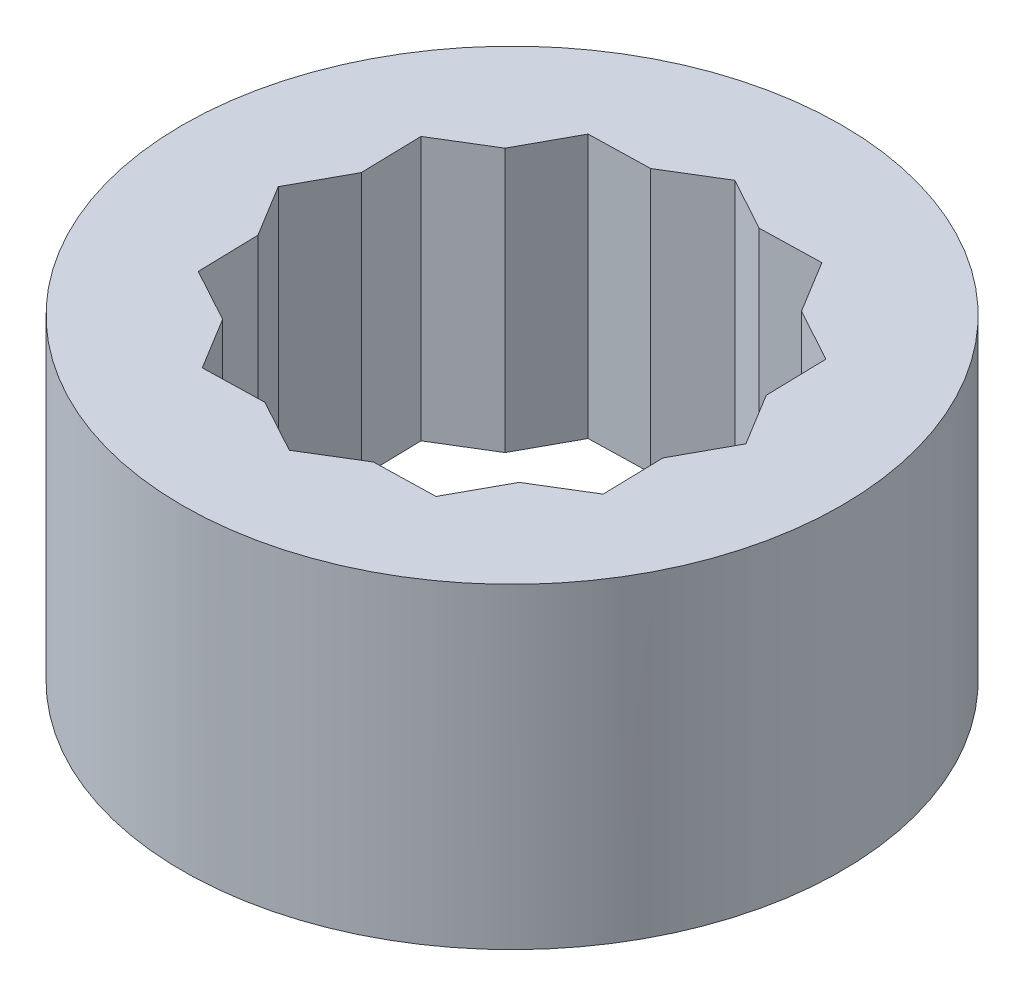
ISO-10303-21;
HEADER;
FILE_DESCRIPTION(('STEP AP214'),'2;1');
FILE_NAME('part.step','',(''),(''),'','','');
FILE_SCHEMA(('AUTOMOTIVE_DESIGN { 1 0 10303 214 1 1 1 1 }'));
ENDSEC;
DATA;
#1=APPLICATION_CONTEXT('core data for automotive mechanical design processes');
#2=APPLICATION_PROTOCOL_DEFINITION('international standard','automotive_design',2000,#1);
#3=PRODUCT_CONTEXT('',#1,'mechanical');
#4=PRODUCT('Part','Part','',(#3));
#5=PRODUCT_RELATED_PRODUCT_CATEGORY('part','',(#4));
#6=PRODUCT_DEFINITION_FORMATION('','',#4);
#7=PRODUCT_DEFINITION_CONTEXT('part definition',#1,'design');
#8=PRODUCT_DEFINITION('design','',#6,#7);
#9=PRODUCT_DEFINITION_SHAPE('','',#8);
#10=(LENGTH_UNIT() NAMED_UNIT(*) SI_UNIT(.MILLI.,.METRE.));
#11=(NAMED_UNIT(*) PLANE_ANGLE_UNIT() SI_UNIT($,.RADIAN.));
#12=(NAMED_UNIT(*) SI_UNIT($,.STERADIAN.) SOLID_ANGLE_UNIT());
#13=UNCERTAINTY_MEASURE_WITH_UNIT(LENGTH_MEASURE(1.E-05),#10,'distance_accuracy_value','');
#14=(GEOMETRIC_REPRESENTATION_CONTEXT(3) GLOBAL_UNCERTAINTY_ASSIGNED_CONTEXT((#13)) GLOBAL_UNIT_ASSIGNED_CONTEXT((#10,
#11,#12)) REPRESENTATION_CONTEXT('',''));
#15=CARTESIAN_POINT('',(0.,0.,0.));
#16=DIRECTION('',(0.,0.,1.));
#17=DIRECTION('',(1.,0.,0.));
#18=AXIS2_PLACEMENT_3D('',#15,#16,#17);
#19=CARTESIAN_POINT('',(0.,12.7,0.));
#20=DIRECTION('',(0.,-1.,0.));
#21=DIRECTION('',(0.,0.,-1.));
#22=AXIS2_PLACEMENT_3D('',#19,#20,#21);
#23=CYLINDRICAL_SURFACE('',#22,15.875);
#24=CARTESIAN_POINT('',(0.,12.7,0.));
#25=DIRECTION('',(0.,1.,0.));
#26=DIRECTION('',(0.,0.,1.));
#27=AXIS2_PLACEMENT_3D('',#24,#25,#26);
#28=CIRCLE('',#27,15.875);
#29=CARTESIAN_POINT('',(0.,12.7,15.875));
#30=VERTEX_POINT('',#29);
#31=EDGE_CURVE('E11',#30,#30,#28,.T.);
#32=ORIENTED_EDGE('',*,*,#31,.F.);
#33=EDGE_LOOP('',(#32));
#34=FACE_BOUND('',#33,.T.);
#35=CARTESIAN_POINT('',(0.,-2.54,0.));
#36=DIRECTION('',(0.,-1.,0.));
#37=DIRECTION('',(0.,0.,-1.));
#38=AXIS2_PLACEMENT_3D('',#35,#36,#37);
#39=CIRCLE('',#38,15.875);
#40=CARTESIAN_POINT('',(0.,-2.54,-15.875));
#41=VERTEX_POINT('',#40);
#42=EDGE_CURVE('E217',#41,#41,#39,.T.);
#43=ORIENTED_EDGE('',*,*,#42,.F.);
#44=EDGE_LOOP('',(#43));
#45=FACE_BOUND('',#44,.T.);
#46=ADVANCED_FACE('F33',(#34,#45),#23,.T.);
#47=CARTESIAN_POINT('',(0.,12.7,0.));
#48=DIRECTION('',(0.,1.,0.));
#49=DIRECTION('',(0.,0.,1.));
#50=AXIS2_PLACEMENT_3D('',#47,#48,#49);
#51=PLANE('',#50);
#52=DIRECTION('',(0.877865016499251,0.,0.478908146523704));
#53=VECTOR('',#52,1.);
#54=CARTESIAN_POINT('',(-4.56160009563828,12.7,8.36166428215537));
#55=LINE('',#54,#53);
#56=CARTESIAN_POINT('',(-9.38920921981397,12.7,5.72802323900318));
#57=VERTEX_POINT('',#56);
#58=CARTESIAN_POINT('',(-6.80210128742198,12.7,7.13938722033536));
#59=VERTEX_POINT('',#58);
#60=EDGE_CURVE('E47',#57,#59,#55,.T.);
#61=ORIENTED_EDGE('',*,*,#60,.F.);
#62=DIRECTION('',(0.0241858872807774,0.,0.999707478643849));
#63=VECTOR('',#62,1.);
#64=CARTESIAN_POINT('',(-9.52221373408266,12.7,0.230370576349405));
#65=LINE('',#64,#63);
#66=CARTESIAN_POINT('',(-9.46048612418995,12.7,2.78184005655339));
#67=VERTEX_POINT('',#66);
#68=EDGE_CURVE('E136',#67,#57,#65,.T.);
#69=ORIENTED_EDGE('',*,*,#68,.F.);
#70=DIRECTION('',(0.520799332120144,0.,0.853679129218474));
#71=VECTOR('',#70,1.);
#72=CARTESIAN_POINT('',(-8.13129370580596,12.7,4.96061363844437));
#73=LINE('',#72,#71);
#74=CARTESIAN_POINT('',(-10.9953053253075,12.7,0.266009028537395));
#75=VERTEX_POINT('',#74);
#76=EDGE_CURVE('E144',#75,#67,#73,.T.);
#77=ORIENTED_EDGE('',*,*,#76,.F.);
#78=DIRECTION('',(-0.478908146523704,0.,0.877865016499251));
#79=VECTOR('',#78,1.);
#80=CARTESIAN_POINT('',(-8.36166428215536,12.7,-4.56160009563828));
#81=LINE('',#80,#79);
#82=CARTESIAN_POINT('',(-9.58394134397538,12.7,-2.32109890385458));
#83=VERTEX_POINT('',#82);
#84=EDGE_CURVE('E150',#83,#75,#81,.T.);
#85=ORIENTED_EDGE('',*,*,#84,.F.);
#86=DIRECTION('',(0.0241858872807774,0.,0.999707478643849));
#87=VECTOR('',#86,1.);
#88=CARTESIAN_POINT('',(-9.52221373408266,12.7,0.230370576349405));
#89=LINE('',#88,#87);
#90=CARTESIAN_POINT('',(-9.65521824835136,12.7,-5.26728208630436));
#91=VERTEX_POINT('',#90);
#92=EDGE_CURVE('E273',#91,#83,#89,.T.);
#93=ORIENTED_EDGE('',*,*,#92,.F.);
#94=DIRECTION('',(-0.853679129218473,0.,0.520799332120145));
#95=VECTOR('',#94,1.);
#96=CARTESIAN_POINT('',(-4.96061363844438,12.7,-8.13129370580596));
#97=LINE('',#96,#95);
#98=CARTESIAN_POINT('',(-7.13938722033535,12.7,-6.80210128742198));
#99=VERTEX_POINT('',#98);
#100=EDGE_CURVE('E270',#99,#91,#97,.T.);
#101=ORIENTED_EDGE('',*,*,#100,.F.);
#102=DIRECTION('',(-0.478908146523704,0.,0.877865016499251));
#103=VECTOR('',#102,1.);
#104=CARTESIAN_POINT('',(-8.36166428215536,12.7,-4.56160009563828));
#105=LINE('',#104,#103);
#106=CARTESIAN_POINT('',(-5.72802323900318,12.7,-9.38920921981396));
#107=VERTEX_POINT('',#106);
#108=EDGE_CURVE('E267',#107,#99,#105,.T.);
#109=ORIENTED_EDGE('',*,*,#108,.F.);
#110=DIRECTION('',(-0.999707478643849,0.,0.0241858872807775));
#111=VECTOR('',#110,1.);
#112=CARTESIAN_POINT('',(-0.230370576349406,12.7,-9.52221373408266));
#113=LINE('',#112,#111);
#114=CARTESIAN_POINT('',(-2.7818400565534,12.7,-9.46048612418994));
#115=VERTEX_POINT('',#114);
#116=EDGE_CURVE('E264',#115,#107,#113,.T.);
#117=ORIENTED_EDGE('',*,*,#116,.F.);
#118=DIRECTION('',(-0.853679129218473,0.,0.520799332120145));
#119=VECTOR('',#118,1.);
#120=CARTESIAN_POINT('',(-4.96061363844438,12.7,-8.13129370580596));
#121=LINE('',#120,#119);
#122=CARTESIAN_POINT('',(-0.266009028537394,12.7,-10.9953053253076));
#123=VERTEX_POINT('',#122);
#124=EDGE_CURVE('E261',#123,#115,#121,.T.);
#125=ORIENTED_EDGE('',*,*,#124,.F.);
#126=DIRECTION('',(-0.877865016499251,0.,-0.478908146523704));
#127=VECTOR('',#126,1.);
#128=CARTESIAN_POINT('',(4.56160009563828,12.7,-8.36166428215537));
#129=LINE('',#128,#127);
#130=CARTESIAN_POINT('',(2.3210989038546,12.7,-9.58394134397537));
#131=VERTEX_POINT('',#130);
#132=EDGE_CURVE('E258',#131,#123,#129,.T.);
#133=ORIENTED_EDGE('',*,*,#132,.F.);
#134=DIRECTION('',(-0.999707478643849,0.,0.0241858872807775));
#135=VECTOR('',#134,1.);
#136=CARTESIAN_POINT('',(-0.230370576349406,12.7,-9.52221373408266));
#137=LINE('',#136,#135);
#138=CARTESIAN_POINT('',(5.26728208630437,12.7,-9.65521824835136));
#139=VERTEX_POINT('',#138);
#140=EDGE_CURVE('E255',#139,#131,#137,.T.);
#141=ORIENTED_EDGE('',*,*,#140,.F.);
#142=DIRECTION('',(-0.520799332120144,0.,-0.853679129218474));
#143=VECTOR('',#142,1.);
#144=CARTESIAN_POINT('',(8.13129370580596,12.7,-4.96061363844438));
#145=LINE('',#144,#143);
#146=CARTESIAN_POINT('',(6.80210128742198,12.7,-7.13938722033536));
#147=VERTEX_POINT('',#146);
#148=EDGE_CURVE('E252',#147,#139,#145,.T.);
#149=ORIENTED_EDGE('',*,*,#148,.F.);
#150=DIRECTION('',(-0.877865016499251,0.,-0.478908146523704));
#151=VECTOR('',#150,1.);
#152=CARTESIAN_POINT('',(4.56160009563828,12.7,-8.36166428215537));
#153=LINE('',#152,#151);
#154=CARTESIAN_POINT('',(9.38920921981396,12.7,-5.72802323900319));
#155=VERTEX_POINT('',#154);
#156=EDGE_CURVE('E249',#155,#147,#153,.T.);
#157=ORIENTED_EDGE('',*,*,#156,.F.);
#158=DIRECTION('',(-0.0241858872807774,0.,-0.999707478643849));
#159=VECTOR('',#158,1.);
#160=CARTESIAN_POINT('',(9.52221373408266,12.7,-0.230370576349404));
#161=LINE('',#160,#159);
#162=CARTESIAN_POINT('',(9.46048612418994,12.7,-2.7818400565534));
#163=VERTEX_POINT('',#162);
#164=EDGE_CURVE('E246',#163,#155,#161,.T.);
#165=ORIENTED_EDGE('',*,*,#164,.F.);
#166=DIRECTION('',(-0.520799332120144,0.,-0.853679129218474));
#167=VECTOR('',#166,1.);
#168=CARTESIAN_POINT('',(8.13129370580596,12.7,-4.96061363844438));
#169=LINE('',#168,#167);
#170=CARTESIAN_POINT('',(10.9953053253076,12.7,-0.266009028537397));
#171=VERTEX_POINT('',#170);
#172=EDGE_CURVE('E243',#171,#163,#169,.T.);
#173=ORIENTED_EDGE('',*,*,#172,.F.);
#174=DIRECTION('',(0.478908146523704,0.,-0.877865016499251));
#175=VECTOR('',#174,1.);
#176=CARTESIAN_POINT('',(8.36166428215537,12.7,4.56160009563828));
#177=LINE('',#176,#175);
#178=CARTESIAN_POINT('',(9.58394134397537,12.7,2.3210989038546));
#179=VERTEX_POINT('',#178);
#180=EDGE_CURVE('E240',#179,#171,#177,.T.);
#181=ORIENTED_EDGE('',*,*,#180,.F.);
#182=DIRECTION('',(-0.0241858872807774,0.,-0.999707478643849));
#183=VECTOR('',#182,1.);
#184=CARTESIAN_POINT('',(9.52221373408266,12.7,-0.230370576349404));
#185=LINE('',#184,#183);
#186=CARTESIAN_POINT('',(9.65521824835136,12.7,5.26728208630436));
#187=VERTEX_POINT('',#186);
#188=EDGE_CURVE('E237',#187,#179,#185,.T.);
#189=ORIENTED_EDGE('',*,*,#188,.F.);
#190=DIRECTION('',(0.853679129218474,0.,-0.520799332120144));
#191=VECTOR('',#190,1.);
#192=CARTESIAN_POINT('',(4.96061363844437,12.7,8.13129370580595));
#193=LINE('',#192,#191);
#194=CARTESIAN_POINT('',(7.13938722033537,12.7,6.80210128742196));
#195=VERTEX_POINT('',#194);
#196=EDGE_CURVE('E234',#195,#187,#193,.T.);
#197=ORIENTED_EDGE('',*,*,#196,.F.);
#198=DIRECTION('',(0.478908146523704,0.,-0.877865016499251));
#199=VECTOR('',#198,1.);
#200=CARTESIAN_POINT('',(8.36166428215537,12.7,4.56160009563828));
#201=LINE('',#200,#199);
#202=CARTESIAN_POINT('',(5.72802323900318,12.7,9.38920921981396));
#203=VERTEX_POINT('',#202);
#204=EDGE_CURVE('E231',#203,#195,#201,.T.);
#205=ORIENTED_EDGE('',*,*,#204,.F.);
#206=DIRECTION('',(0.999707478643849,0.,-0.0241858872807775));
#207=VECTOR('',#206,1.);
#208=CARTESIAN_POINT('',(0.230370576349406,12.7,9.52221373408266));
#209=LINE('',#208,#207);
#210=CARTESIAN_POINT('',(2.78184005655337,12.7,9.46048612418994));
#211=VERTEX_POINT('',#210);
#212=EDGE_CURVE('E228',#211,#203,#209,.T.);
#213=ORIENTED_EDGE('',*,*,#212,.F.);
#214=DIRECTION('',(0.853679129218474,0.,-0.520799332120144));
#215=VECTOR('',#214,1.);
#216=CARTESIAN_POINT('',(4.96061363844437,12.7,8.13129370580595));
#217=LINE('',#216,#215);
#218=CARTESIAN_POINT('',(0.266009028537384,12.7,10.9953053253075));
#219=VERTEX_POINT('',#218);
#220=EDGE_CURVE('E225',#219,#211,#217,.T.);
#221=ORIENTED_EDGE('',*,*,#220,.F.);
#222=DIRECTION('',(0.877865016499251,0.,0.478908146523704));
#223=VECTOR('',#222,1.);
#224=CARTESIAN_POINT('',(-4.56160009563828,12.7,8.36166428215537));
#225=LINE('',#224,#223);
#226=CARTESIAN_POINT('',(-2.3210989038546,12.7,9.58394134397537));
#227=VERTEX_POINT('',#226);
#228=EDGE_CURVE('E222',#227,#219,#225,.T.);
#229=ORIENTED_EDGE('',*,*,#228,.F.);
#230=DIRECTION('',(0.999707478643849,0.,-0.0241858872807775));
#231=VECTOR('',#230,1.);
#232=CARTESIAN_POINT('',(0.230370576349406,12.7,9.52221373408266));
#233=LINE('',#232,#231);
#234=CARTESIAN_POINT('',(-5.26728208630437,12.7,9.65521824835136));
#235=VERTEX_POINT('',#234);
#236=EDGE_CURVE('E219',#235,#227,#233,.T.);
#237=ORIENTED_EDGE('',*,*,#236,.F.);
#238=DIRECTION('',(0.520799332120144,0.,0.853679129218474));
#239=VECTOR('',#238,1.);
#240=CARTESIAN_POINT('',(-8.13129370580596,12.7,4.96061363844437));
#241=LINE('',#240,#239);
#242=EDGE_CURVE('E216',#59,#235,#241,.T.);
#243=ORIENTED_EDGE('',*,*,#242,.F.);
#244=EDGE_LOOP('',(#61,#69,#77,#85,#93,#101,#109,#117,#125,#133,#141,#149,#157,#165,#173,#181,
#189,#197,#205,#213,#221,#229,#237,#243));
#245=FACE_BOUND('',#244,.T.);
#246=ORIENTED_EDGE('',*,*,#31,.T.);
#247=EDGE_LOOP('',(#246));
#248=FACE_BOUND('',#247,.T.);
#249=ADVANCED_FACE('F152',(#245,#248),#51,.T.);
#250=CARTESIAN_POINT('',(-4.56160009563828,0.,8.36166428215537));
#251=DIRECTION('',(-0.478908146523704,0.,0.877865016499251));
#252=DIRECTION('',(0.877865016499251,0.,0.478908146523704));
#253=AXIS2_PLACEMENT_3D('',#250,#251,#252);
#254=PLANE('',#253);
#255=ORIENTED_EDGE('',*,*,#60,.T.);
#256=DIRECTION('',(0.,1.,0.));
#257=VECTOR('',#256,1.);
#258=CARTESIAN_POINT('',(-6.80210128742197,0.,7.13938722033536));
#259=LINE('',#258,#257);
#260=CARTESIAN_POINT('',(-6.80210128742197,0.,7.13938722033536));
#261=VERTEX_POINT('',#260);
#262=EDGE_CURVE('E203',#261,#59,#259,.T.);
#263=ORIENTED_EDGE('',*,*,#262,.F.);
#264=DIRECTION('',(0.877865016499251,0.,0.478908146523704));
#265=VECTOR('',#264,1.);
#266=CARTESIAN_POINT('',(-4.56160009563828,0.,8.36166428215537));
#267=LINE('',#266,#265);
#268=CARTESIAN_POINT('',(-9.38920921981397,0.,5.72802323900318));
#269=VERTEX_POINT('',#268);
#270=EDGE_CURVE('E155',#269,#261,#267,.T.);
#271=ORIENTED_EDGE('',*,*,#270,.F.);
#272=DIRECTION('',(0.,1.,0.));
#273=VECTOR('',#272,1.);
#274=CARTESIAN_POINT('',(-9.38920921981397,0.,5.72802323900318));
#275=LINE('',#274,#273);
#276=EDGE_CURVE('E40',#269,#57,#275,.T.);
#277=ORIENTED_EDGE('',*,*,#276,.T.);
#278=EDGE_LOOP('',(#255,#263,#271,#277));
#279=FACE_BOUND('',#278,.T.);
#280=ADVANCED_FACE('F433',(#279),#254,.F.);
#281=CARTESIAN_POINT('',(-9.52221373408266,0.,0.230370576349405));
#282=DIRECTION('',(-0.999707478643849,0.,0.0241858872807774));
#283=DIRECTION('',(0.0241858872807774,0.,0.999707478643849));
#284=AXIS2_PLACEMENT_3D('',#281,#282,#283);
#285=PLANE('',#284);
#286=ORIENTED_EDGE('',*,*,#68,.T.);
#287=ORIENTED_EDGE('',*,*,#276,.F.);
#288=DIRECTION('',(0.0241858872807774,0.,0.999707478643849));
#289=VECTOR('',#288,1.);
#290=CARTESIAN_POINT('',(-9.52221373408266,0.,0.230370576349405));
#291=LINE('',#290,#289);
#292=CARTESIAN_POINT('',(-9.46048612418995,0.,2.78184005655339));
#293=VERTEX_POINT('',#292);
#294=EDGE_CURVE('E138',#293,#269,#291,.T.);
#295=ORIENTED_EDGE('',*,*,#294,.F.);
#296=DIRECTION('',(0.,1.,0.));
#297=VECTOR('',#296,1.);
#298=CARTESIAN_POINT('',(-9.46048612418995,0.,2.78184005655339));
#299=LINE('',#298,#297);
#300=EDGE_CURVE('E131',#293,#67,#299,.T.);
#301=ORIENTED_EDGE('',*,*,#300,.T.);
#302=EDGE_LOOP('',(#286,#287,#295,#301));
#303=FACE_BOUND('',#302,.T.);
#304=ADVANCED_FACE('F133',(#303),#285,.F.);
#305=CARTESIAN_POINT('',(-8.13129370580596,0.,4.96061363844437));
#306=DIRECTION('',(-0.853679129218474,0.,0.520799332120144));
#307=DIRECTION('',(0.520799332120144,0.,0.853679129218474));
#308=AXIS2_PLACEMENT_3D('',#305,#306,#307);
#309=PLANE('',#308);
#310=ORIENTED_EDGE('',*,*,#76,.T.);
#311=ORIENTED_EDGE('',*,*,#300,.F.);
#312=DIRECTION('',(0.520799332120144,0.,0.853679129218474));
#313=VECTOR('',#312,1.);
#314=CARTESIAN_POINT('',(-8.13129370580596,0.,4.96061363844437));
#315=LINE('',#314,#313);
#316=CARTESIAN_POINT('',(-10.9953053253075,0.,0.266009028537395));
#317=VERTEX_POINT('',#316);
#318=EDGE_CURVE('E207',#317,#293,#315,.T.);
#319=ORIENTED_EDGE('',*,*,#318,.F.);
#320=DIRECTION('',(0.,1.,0.));
#321=VECTOR('',#320,1.);
#322=CARTESIAN_POINT('',(-10.9953053253075,0.,0.266009028537395));
#323=LINE('',#322,#321);
#324=EDGE_CURVE('E141',#317,#75,#323,.T.);
#325=ORIENTED_EDGE('',*,*,#324,.T.);
#326=EDGE_LOOP('',(#310,#311,#319,#325));
#327=FACE_BOUND('',#326,.T.);
#328=ADVANCED_FACE('F145',(#327),#309,.F.);
#329=CARTESIAN_POINT('',(-8.36166428215536,0.,-4.56160009563828));
#330=DIRECTION('',(-0.877865016499251,0.,-0.478908146523704));
#331=DIRECTION('',(-0.478908146523704,0.,0.877865016499251));
#332=AXIS2_PLACEMENT_3D('',#329,#330,#331);
#333=PLANE('',#332);
#334=ORIENTED_EDGE('',*,*,#84,.T.);
#335=ORIENTED_EDGE('',*,*,#324,.F.);
#336=DIRECTION('',(-0.478908146523704,0.,0.877865016499251));
#337=VECTOR('',#336,1.);
#338=CARTESIAN_POINT('',(-8.36166428215536,0.,-4.56160009563828));
#339=LINE('',#338,#337);
#340=CARTESIAN_POINT('',(-9.58394134397538,0.,-2.32109890385458));
#341=VERTEX_POINT('',#340);
#342=EDGE_CURVE('E211',#341,#317,#339,.T.);
#343=ORIENTED_EDGE('',*,*,#342,.F.);
#344=DIRECTION('',(0.,1.,0.));
#345=VECTOR('',#344,1.);
#346=CARTESIAN_POINT('',(-9.58394134397538,0.,-2.32109890385458));
#347=LINE('',#346,#345);
#348=EDGE_CURVE('E164',#341,#83,#347,.T.);
#349=ORIENTED_EDGE('',*,*,#348,.T.);
#350=EDGE_LOOP('',(#334,#335,#343,#349));
#351=FACE_BOUND('',#350,.T.);
#352=ADVANCED_FACE('F276',(#351),#333,.F.);
#353=CARTESIAN_POINT('',(-9.52221373408266,0.,0.230370576349405));
#354=DIRECTION('',(-0.999707478643849,0.,0.0241858872807774));
#355=DIRECTION('',(0.0241858872807774,0.,0.999707478643849));
#356=AXIS2_PLACEMENT_3D('',#353,#354,#355);
#357=PLANE('',#356);
#358=ORIENTED_EDGE('',*,*,#92,.T.);
#359=ORIENTED_EDGE('',*,*,#348,.F.);
#360=DIRECTION('',(0.0241858872807774,0.,0.999707478643849));
#361=VECTOR('',#360,1.);
#362=CARTESIAN_POINT('',(-9.52221373408266,0.,0.230370576349405));
#363=LINE('',#362,#361);
#364=CARTESIAN_POINT('',(-9.65521824835136,0.,-5.26728208630436));
#365=VERTEX_POINT('',#364);
#366=EDGE_CURVE('E56',#365,#341,#363,.T.);
#367=ORIENTED_EDGE('',*,*,#366,.F.);
#368=DIRECTION('',(0.,1.,0.));
#369=VECTOR('',#368,1.);
#370=CARTESIAN_POINT('',(-9.65521824835136,0.,-5.26728208630436));
#371=LINE('',#370,#369);
#372=EDGE_CURVE('E166',#365,#91,#371,.T.);
#373=ORIENTED_EDGE('',*,*,#372,.T.);
#374=EDGE_LOOP('',(#358,#359,#367,#373));
#375=FACE_BOUND('',#374,.T.);
#376=ADVANCED_FACE('F283',(#375),#357,.F.);
#377=CARTESIAN_POINT('',(-4.96061363844438,0.,-8.13129370580596));
#378=DIRECTION('',(-0.520799332120145,0.,-0.853679129218473));
#379=DIRECTION('',(-0.853679129218473,0.,0.520799332120145));
#380=AXIS2_PLACEMENT_3D('',#377,#378,#379);
#381=PLANE('',#380);
#382=ORIENTED_EDGE('',*,*,#100,.T.);
#383=ORIENTED_EDGE('',*,*,#372,.F.);
#384=DIRECTION('',(-0.853679129218473,0.,0.520799332120145));
#385=VECTOR('',#384,1.);
#386=CARTESIAN_POINT('',(-4.96061363844438,0.,-8.13129370580596));
#387=LINE('',#386,#385);
#388=CARTESIAN_POINT('',(-7.13938722033535,0.,-6.80210128742198));
#389=VERTEX_POINT('',#388);
#390=EDGE_CURVE('E291',#389,#365,#387,.T.);
#391=ORIENTED_EDGE('',*,*,#390,.F.);
#392=DIRECTION('',(0.,1.,0.));
#393=VECTOR('',#392,1.);
#394=CARTESIAN_POINT('',(-7.13938722033535,0.,-6.80210128742198));
#395=LINE('',#394,#393);
#396=EDGE_CURVE('E168',#389,#99,#395,.T.);
#397=ORIENTED_EDGE('',*,*,#396,.T.);
#398=EDGE_LOOP('',(#382,#383,#391,#397));
#399=FACE_BOUND('',#398,.T.);
#400=ADVANCED_FACE('F288',(#399),#381,.F.);
#401=CARTESIAN_POINT('',(-8.36166428215536,0.,-4.56160009563828));
#402=DIRECTION('',(-0.877865016499251,0.,-0.478908146523704));
#403=DIRECTION('',(-0.478908146523704,0.,0.877865016499251));
#404=AXIS2_PLACEMENT_3D('',#401,#402,#403);
#405=PLANE('',#404);
#406=ORIENTED_EDGE('',*,*,#108,.T.);
#407=ORIENTED_EDGE('',*,*,#396,.F.);
#408=DIRECTION('',(-0.478908146523704,0.,0.877865016499251));
#409=VECTOR('',#408,1.);
#410=CARTESIAN_POINT('',(-8.36166428215536,0.,-4.56160009563828));
#411=LINE('',#410,#409);
#412=CARTESIAN_POINT('',(-5.72802323900318,0.,-9.38920921981396));
#413=VERTEX_POINT('',#412);
#414=EDGE_CURVE('E474',#413,#389,#411,.T.);
#415=ORIENTED_EDGE('',*,*,#414,.F.);
#416=DIRECTION('',(0.,1.,0.));
#417=VECTOR('',#416,1.);
#418=CARTESIAN_POINT('',(-5.72802323900318,0.,-9.38920921981396));
#419=LINE('',#418,#417);
#420=EDGE_CURVE('E170',#413,#107,#419,.T.);
#421=ORIENTED_EDGE('',*,*,#420,.T.);
#422=EDGE_LOOP('',(#406,#407,#415,#421));
#423=FACE_BOUND('',#422,.T.);
#424=ADVANCED_FACE('F294',(#423),#405,.F.);
#425=CARTESIAN_POINT('',(-0.230370576349406,0.,-9.52221373408266));
#426=DIRECTION('',(-0.0241858872807775,0.,-0.999707478643849));
#427=DIRECTION('',(-0.999707478643849,0.,0.0241858872807775));
#428=AXIS2_PLACEMENT_3D('',#425,#426,#427);
#429=PLANE('',#428);
#430=ORIENTED_EDGE('',*,*,#116,.T.);
#431=ORIENTED_EDGE('',*,*,#420,.F.);
#432=DIRECTION('',(-0.999707478643849,0.,0.0241858872807775));
#433=VECTOR('',#432,1.);
#434=CARTESIAN_POINT('',(-0.230370576349406,0.,-9.52221373408266));
#435=LINE('',#434,#433);
#436=CARTESIAN_POINT('',(-2.7818400565534,0.,-9.46048612418994));
#437=VERTEX_POINT('',#436);
#438=EDGE_CURVE('E306',#437,#413,#435,.T.);
#439=ORIENTED_EDGE('',*,*,#438,.F.);
#440=DIRECTION('',(0.,1.,0.));
#441=VECTOR('',#440,1.);
#442=CARTESIAN_POINT('',(-2.7818400565534,0.,-9.46048612418994));
#443=LINE('',#442,#441);
#444=EDGE_CURVE('E172',#437,#115,#443,.T.);
#445=ORIENTED_EDGE('',*,*,#444,.T.);
#446=EDGE_LOOP('',(#430,#431,#439,#445));
#447=FACE_BOUND('',#446,.T.);
#448=ADVANCED_FACE('F300',(#447),#429,.F.);
#449=CARTESIAN_POINT('',(-4.96061363844438,0.,-8.13129370580596));
#450=DIRECTION('',(-0.520799332120145,0.,-0.853679129218473));
#451=DIRECTION('',(-0.853679129218473,0.,0.520799332120145));
#452=AXIS2_PLACEMENT_3D('',#449,#450,#451);
#453=PLANE('',#452);
#454=ORIENTED_EDGE('',*,*,#124,.T.);
#455=ORIENTED_EDGE('',*,*,#444,.F.);
#456=DIRECTION('',(-0.853679129218473,0.,0.520799332120145));
#457=VECTOR('',#456,1.);
#458=CARTESIAN_POINT('',(-4.96061363844438,0.,-8.13129370580596));
#459=LINE('',#458,#457);
#460=CARTESIAN_POINT('',(-0.266009028537394,0.,-10.9953053253076));
#461=VERTEX_POINT('',#460);
#462=EDGE_CURVE('E313',#461,#437,#459,.T.);
#463=ORIENTED_EDGE('',*,*,#462,.F.);
#464=DIRECTION('',(0.,1.,0.));
#465=VECTOR('',#464,1.);
#466=CARTESIAN_POINT('',(-0.266009028537394,0.,-10.9953053253076));
#467=LINE('',#466,#465);
#468=EDGE_CURVE('E174',#461,#123,#467,.T.);
#469=ORIENTED_EDGE('',*,*,#468,.T.);
#470=EDGE_LOOP('',(#454,#455,#463,#469));
#471=FACE_BOUND('',#470,.T.);
#472=ADVANCED_FACE('F309',(#471),#453,.F.);
#473=CARTESIAN_POINT('',(4.56160009563828,0.,-8.36166428215537));
#474=DIRECTION('',(0.478908146523704,0.,-0.877865016499251));
#475=DIRECTION('',(-0.877865016499251,0.,-0.478908146523704));
#476=AXIS2_PLACEMENT_3D('',#473,#474,#475);
#477=PLANE('',#476);
#478=ORIENTED_EDGE('',*,*,#132,.T.);
#479=ORIENTED_EDGE('',*,*,#468,.F.);
#480=DIRECTION('',(-0.877865016499251,0.,-0.478908146523704));
#481=VECTOR('',#480,1.);
#482=CARTESIAN_POINT('',(4.56160009563828,0.,-8.36166428215537));
#483=LINE('',#482,#481);
#484=CARTESIAN_POINT('',(2.3210989038546,0.,-9.58394134397537));
#485=VERTEX_POINT('',#484);
#486=EDGE_CURVE('E469',#485,#461,#483,.T.);
#487=ORIENTED_EDGE('',*,*,#486,.F.);
#488=DIRECTION('',(0.,1.,0.));
#489=VECTOR('',#488,1.);
#490=CARTESIAN_POINT('',(2.3210989038546,0.,-9.58394134397537));
#491=LINE('',#490,#489);
#492=EDGE_CURVE('E176',#485,#131,#491,.T.);
#493=ORIENTED_EDGE('',*,*,#492,.T.);
#494=EDGE_LOOP('',(#478,#479,#487,#493));
#495=FACE_BOUND('',#494,.T.);
#496=ADVANCED_FACE('F316',(#495),#477,.F.);
#497=CARTESIAN_POINT('',(-0.230370576349406,0.,-9.52221373408266));
#498=DIRECTION('',(-0.0241858872807775,0.,-0.999707478643849));
#499=DIRECTION('',(-0.999707478643849,0.,0.0241858872807775));
#500=AXIS2_PLACEMENT_3D('',#497,#498,#499);
#501=PLANE('',#500);
#502=ORIENTED_EDGE('',*,*,#140,.T.);
#503=ORIENTED_EDGE('',*,*,#492,.F.);
#504=DIRECTION('',(-0.999707478643849,0.,0.0241858872807775));
#505=VECTOR('',#504,1.);
#506=CARTESIAN_POINT('',(-0.230370576349406,0.,-9.52221373408266));
#507=LINE('',#506,#505);
#508=CARTESIAN_POINT('',(5.26728208630437,0.,-9.65521824835136));
#509=VERTEX_POINT('',#508);
#510=EDGE_CURVE('E328',#509,#485,#507,.T.);
#511=ORIENTED_EDGE('',*,*,#510,.F.);
#512=DIRECTION('',(0.,1.,0.));
#513=VECTOR('',#512,1.);
#514=CARTESIAN_POINT('',(5.26728208630437,0.,-9.65521824835136));
#515=LINE('',#514,#513);
#516=EDGE_CURVE('E178',#509,#139,#515,.T.);
#517=ORIENTED_EDGE('',*,*,#516,.T.);
#518=EDGE_LOOP('',(#502,#503,#511,#517));
#519=FACE_BOUND('',#518,.T.);
#520=ADVANCED_FACE('F322',(#519),#501,.F.);
#521=CARTESIAN_POINT('',(8.13129370580596,0.,-4.96061363844438));
#522=DIRECTION('',(0.853679129218474,0.,-0.520799332120144));
#523=DIRECTION('',(-0.520799332120144,0.,-0.853679129218474));
#524=AXIS2_PLACEMENT_3D('',#521,#522,#523);
#525=PLANE('',#524);
#526=ORIENTED_EDGE('',*,*,#148,.T.);
#527=ORIENTED_EDGE('',*,*,#516,.F.);
#528=DIRECTION('',(-0.520799332120144,0.,-0.853679129218474));
#529=VECTOR('',#528,1.);
#530=CARTESIAN_POINT('',(8.13129370580596,0.,-4.96061363844438));
#531=LINE('',#530,#529);
#532=CARTESIAN_POINT('',(6.80210128742198,0.,-7.13938722033536));
#533=VERTEX_POINT('',#532);
#534=EDGE_CURVE('E335',#533,#509,#531,.T.);
#535=ORIENTED_EDGE('',*,*,#534,.F.);
#536=DIRECTION('',(0.,1.,0.));
#537=VECTOR('',#536,1.);
#538=CARTESIAN_POINT('',(6.80210128742198,0.,-7.13938722033536));
#539=LINE('',#538,#537);
#540=EDGE_CURVE('E180',#533,#147,#539,.T.);
#541=ORIENTED_EDGE('',*,*,#540,.T.);
#542=EDGE_LOOP('',(#526,#527,#535,#541));
#543=FACE_BOUND('',#542,.T.);
#544=ADVANCED_FACE('F331',(#543),#525,.F.);
#545=CARTESIAN_POINT('',(4.56160009563828,0.,-8.36166428215537));
#546=DIRECTION('',(0.478908146523704,0.,-0.877865016499251));
#547=DIRECTION('',(-0.877865016499251,0.,-0.478908146523704));
#548=AXIS2_PLACEMENT_3D('',#545,#546,#547);
#549=PLANE('',#548);
#550=ORIENTED_EDGE('',*,*,#156,.T.);
#551=ORIENTED_EDGE('',*,*,#540,.F.);
#552=DIRECTION('',(-0.877865016499251,0.,-0.478908146523704));
#553=VECTOR('',#552,1.);
#554=CARTESIAN_POINT('',(4.56160009563828,0.,-8.36166428215537));
#555=LINE('',#554,#553);
#556=CARTESIAN_POINT('',(9.38920921981396,0.,-5.72802323900319));
#557=VERTEX_POINT('',#556);
#558=EDGE_CURVE('E464',#557,#533,#555,.T.);
#559=ORIENTED_EDGE('',*,*,#558,.F.);
#560=DIRECTION('',(0.,1.,0.));
#561=VECTOR('',#560,1.);
#562=CARTESIAN_POINT('',(9.38920921981396,0.,-5.72802323900319));
#563=LINE('',#562,#561);
#564=EDGE_CURVE('E182',#557,#155,#563,.T.);
#565=ORIENTED_EDGE('',*,*,#564,.T.);
#566=EDGE_LOOP('',(#550,#551,#559,#565));
#567=FACE_BOUND('',#566,.T.);
#568=ADVANCED_FACE('F338',(#567),#549,.F.);
#569=CARTESIAN_POINT('',(9.52221373408266,0.,-0.230370576349404));
#570=DIRECTION('',(0.999707478643849,0.,-0.0241858872807774));
#571=DIRECTION('',(-0.0241858872807774,0.,-0.999707478643849));
#572=AXIS2_PLACEMENT_3D('',#569,#570,#571);
#573=PLANE('',#572);
#574=ORIENTED_EDGE('',*,*,#164,.T.);
#575=ORIENTED_EDGE('',*,*,#564,.F.);
#576=DIRECTION('',(-0.0241858872807774,0.,-0.999707478643849));
#577=VECTOR('',#576,1.);
#578=CARTESIAN_POINT('',(9.52221373408266,0.,-0.230370576349404));
#579=LINE('',#578,#577);
#580=CARTESIAN_POINT('',(9.46048612418994,0.,-2.7818400565534));
#581=VERTEX_POINT('',#580);
#582=EDGE_CURVE('E350',#581,#557,#579,.T.);
#583=ORIENTED_EDGE('',*,*,#582,.F.);
#584=DIRECTION('',(0.,1.,0.));
#585=VECTOR('',#584,1.);
#586=CARTESIAN_POINT('',(9.46048612418994,0.,-2.7818400565534));
#587=LINE('',#586,#585);
#588=EDGE_CURVE('E184',#581,#163,#587,.T.);
#589=ORIENTED_EDGE('',*,*,#588,.T.);
#590=EDGE_LOOP('',(#574,#575,#583,#589));
#591=FACE_BOUND('',#590,.T.);
#592=ADVANCED_FACE('F344',(#591),#573,.F.);
#593=CARTESIAN_POINT('',(8.13129370580596,0.,-4.96061363844438));
#594=DIRECTION('',(0.853679129218474,0.,-0.520799332120144));
#595=DIRECTION('',(-0.520799332120144,0.,-0.853679129218474));
#596=AXIS2_PLACEMENT_3D('',#593,#594,#595);
#597=PLANE('',#596);
#598=ORIENTED_EDGE('',*,*,#172,.T.);
#599=ORIENTED_EDGE('',*,*,#588,.F.);
#600=DIRECTION('',(-0.520799332120144,0.,-0.853679129218474));
#601=VECTOR('',#600,1.);
#602=CARTESIAN_POINT('',(8.13129370580596,0.,-4.96061363844438));
#603=LINE('',#602,#601);
#604=CARTESIAN_POINT('',(10.9953053253076,0.,-0.266009028537397));
#605=VERTEX_POINT('',#604);
#606=EDGE_CURVE('E357',#605,#581,#603,.T.);
#607=ORIENTED_EDGE('',*,*,#606,.F.);
#608=DIRECTION('',(0.,1.,0.));
#609=VECTOR('',#608,1.);
#610=CARTESIAN_POINT('',(10.9953053253076,0.,-0.266009028537397));
#611=LINE('',#610,#609);
#612=EDGE_CURVE('E186',#605,#171,#611,.T.);
#613=ORIENTED_EDGE('',*,*,#612,.T.);
#614=EDGE_LOOP('',(#598,#599,#607,#613));
#615=FACE_BOUND('',#614,.T.);
#616=ADVANCED_FACE('F353',(#615),#597,.F.);
#617=CARTESIAN_POINT('',(8.36166428215537,0.,4.56160009563828));
#618=DIRECTION('',(0.877865016499251,0.,0.478908146523704));
#619=DIRECTION('',(0.478908146523705,0.,-0.877865016499251));
#620=AXIS2_PLACEMENT_3D('',#617,#618,#619);
#621=PLANE('',#620);
#622=ORIENTED_EDGE('',*,*,#180,.T.);
#623=ORIENTED_EDGE('',*,*,#612,.F.);
#624=DIRECTION('',(0.478908146523704,0.,-0.877865016499251));
#625=VECTOR('',#624,1.);
#626=CARTESIAN_POINT('',(8.36166428215537,0.,4.56160009563828));
#627=LINE('',#626,#625);
#628=CARTESIAN_POINT('',(9.58394134397537,0.,2.3210989038546));
#629=VERTEX_POINT('',#628);
#630=EDGE_CURVE('E459',#629,#605,#627,.T.);
#631=ORIENTED_EDGE('',*,*,#630,.F.);
#632=DIRECTION('',(0.,1.,0.));
#633=VECTOR('',#632,1.);
#634=CARTESIAN_POINT('',(9.58394134397537,0.,2.3210989038546));
#635=LINE('',#634,#633);
#636=EDGE_CURVE('E188',#629,#179,#635,.T.);
#637=ORIENTED_EDGE('',*,*,#636,.T.);
#638=EDGE_LOOP('',(#622,#623,#631,#637));
#639=FACE_BOUND('',#638,.T.);
#640=ADVANCED_FACE('F360',(#639),#621,.F.);
#641=CARTESIAN_POINT('',(9.52221373408266,0.,-0.230370576349404));
#642=DIRECTION('',(0.999707478643849,0.,-0.0241858872807774));
#643=DIRECTION('',(-0.0241858872807774,0.,-0.999707478643849));
#644=AXIS2_PLACEMENT_3D('',#641,#642,#643);
#645=PLANE('',#644);
#646=ORIENTED_EDGE('',*,*,#188,.T.);
#647=ORIENTED_EDGE('',*,*,#636,.F.);
#648=DIRECTION('',(-0.0241858872807774,0.,-0.999707478643849));
#649=VECTOR('',#648,1.);
#650=CARTESIAN_POINT('',(9.52221373408266,0.,-0.230370576349404));
#651=LINE('',#650,#649);
#652=CARTESIAN_POINT('',(9.65521824835136,0.,5.26728208630436));
#653=VERTEX_POINT('',#652);
#654=EDGE_CURVE('E372',#653,#629,#651,.T.);
#655=ORIENTED_EDGE('',*,*,#654,.F.);
#656=DIRECTION('',(0.,1.,0.));
#657=VECTOR('',#656,1.);
#658=CARTESIAN_POINT('',(9.65521824835136,0.,5.26728208630436));
#659=LINE('',#658,#657);
#660=EDGE_CURVE('E190',#653,#187,#659,.T.);
#661=ORIENTED_EDGE('',*,*,#660,.T.);
#662=EDGE_LOOP('',(#646,#647,#655,#661));
#663=FACE_BOUND('',#662,.T.);
#664=ADVANCED_FACE('F366',(#663),#645,.F.);
#665=CARTESIAN_POINT('',(4.96061363844437,0.,8.13129370580595));
#666=DIRECTION('',(0.520799332120144,0.,0.853679129218474));
#667=DIRECTION('',(0.853679129218474,0.,-0.520799332120144));
#668=AXIS2_PLACEMENT_3D('',#665,#666,#667);
#669=PLANE('',#668);
#670=ORIENTED_EDGE('',*,*,#196,.T.);
#671=ORIENTED_EDGE('',*,*,#660,.F.);
#672=DIRECTION('',(0.853679129218474,0.,-0.520799332120144));
#673=VECTOR('',#672,1.);
#674=CARTESIAN_POINT('',(4.96061363844437,0.,8.13129370580595));
#675=LINE('',#674,#673);
#676=CARTESIAN_POINT('',(7.13938722033537,0.,6.80210128742196));
#677=VERTEX_POINT('',#676);
#678=EDGE_CURVE('E379',#677,#653,#675,.T.);
#679=ORIENTED_EDGE('',*,*,#678,.F.);
#680=DIRECTION('',(0.,1.,0.));
#681=VECTOR('',#680,1.);
#682=CARTESIAN_POINT('',(7.13938722033537,0.,6.80210128742196));
#683=LINE('',#682,#681);
#684=EDGE_CURVE('E192',#677,#195,#683,.T.);
#685=ORIENTED_EDGE('',*,*,#684,.T.);
#686=EDGE_LOOP('',(#670,#671,#679,#685));
#687=FACE_BOUND('',#686,.T.);
#688=ADVANCED_FACE('F375',(#687),#669,.F.);
#689=CARTESIAN_POINT('',(8.36166428215537,0.,4.56160009563828));
#690=DIRECTION('',(0.877865016499251,0.,0.478908146523704));
#691=DIRECTION('',(0.478908146523705,0.,-0.877865016499251));
#692=AXIS2_PLACEMENT_3D('',#689,#690,#691);
#693=PLANE('',#692);
#694=ORIENTED_EDGE('',*,*,#204,.T.);
#695=ORIENTED_EDGE('',*,*,#684,.F.);
#696=DIRECTION('',(0.478908146523704,0.,-0.877865016499251));
#697=VECTOR('',#696,1.);
#698=CARTESIAN_POINT('',(8.36166428215537,0.,4.56160009563828));
#699=LINE('',#698,#697);
#700=CARTESIAN_POINT('',(5.72802323900318,0.,9.38920921981396));
#701=VERTEX_POINT('',#700);
#702=EDGE_CURVE('E454',#701,#677,#699,.T.);
#703=ORIENTED_EDGE('',*,*,#702,.F.);
#704=DIRECTION('',(0.,1.,0.));
#705=VECTOR('',#704,1.);
#706=CARTESIAN_POINT('',(5.72802323900318,0.,9.38920921981396));
#707=LINE('',#706,#705);
#708=EDGE_CURVE('E194',#701,#203,#707,.T.);
#709=ORIENTED_EDGE('',*,*,#708,.T.);
#710=EDGE_LOOP('',(#694,#695,#703,#709));
#711=FACE_BOUND('',#710,.T.);
#712=ADVANCED_FACE('F382',(#711),#693,.F.);
#713=CARTESIAN_POINT('',(0.230370576349406,0.,9.52221373408266));
#714=DIRECTION('',(0.0241858872807775,0.,0.999707478643849));
#715=DIRECTION('',(0.999707478643849,0.,-0.0241858872807775));
#716=AXIS2_PLACEMENT_3D('',#713,#714,#715);
#717=PLANE('',#716);
#718=ORIENTED_EDGE('',*,*,#212,.T.);
#719=ORIENTED_EDGE('',*,*,#708,.F.);
#720=DIRECTION('',(0.999707478643849,0.,-0.0241858872807775));
#721=VECTOR('',#720,1.);
#722=CARTESIAN_POINT('',(0.230370576349406,0.,9.52221373408266));
#723=LINE('',#722,#721);
#724=CARTESIAN_POINT('',(2.78184005655337,0.,9.46048612418994));
#725=VERTEX_POINT('',#724);
#726=EDGE_CURVE('E394',#725,#701,#723,.T.);
#727=ORIENTED_EDGE('',*,*,#726,.F.);
#728=DIRECTION('',(0.,1.,0.));
#729=VECTOR('',#728,1.);
#730=CARTESIAN_POINT('',(2.78184005655337,0.,9.46048612418994));
#731=LINE('',#730,#729);
#732=EDGE_CURVE('E196',#725,#211,#731,.T.);
#733=ORIENTED_EDGE('',*,*,#732,.T.);
#734=EDGE_LOOP('',(#718,#719,#727,#733));
#735=FACE_BOUND('',#734,.T.);
#736=ADVANCED_FACE('F388',(#735),#717,.F.);
#737=CARTESIAN_POINT('',(4.96061363844437,0.,8.13129370580595));
#738=DIRECTION('',(0.520799332120144,0.,0.853679129218474));
#739=DIRECTION('',(0.853679129218474,0.,-0.520799332120144));
#740=AXIS2_PLACEMENT_3D('',#737,#738,#739);
#741=PLANE('',#740);
#742=ORIENTED_EDGE('',*,*,#220,.T.);
#743=ORIENTED_EDGE('',*,*,#732,.F.);
#744=DIRECTION('',(0.853679129218474,0.,-0.520799332120144));
#745=VECTOR('',#744,1.);
#746=CARTESIAN_POINT('',(4.96061363844437,0.,8.13129370580595));
#747=LINE('',#746,#745);
#748=CARTESIAN_POINT('',(0.266009028537384,0.,10.9953053253075));
#749=VERTEX_POINT('',#748);
#750=EDGE_CURVE('E401',#749,#725,#747,.T.);
#751=ORIENTED_EDGE('',*,*,#750,.F.);
#752=DIRECTION('',(0.,1.,0.));
#753=VECTOR('',#752,1.);
#754=CARTESIAN_POINT('',(0.266009028537384,0.,10.9953053253075));
#755=LINE('',#754,#753);
#756=EDGE_CURVE('E198',#749,#219,#755,.T.);
#757=ORIENTED_EDGE('',*,*,#756,.T.);
#758=EDGE_LOOP('',(#742,#743,#751,#757));
#759=FACE_BOUND('',#758,.T.);
#760=ADVANCED_FACE('F397',(#759),#741,.F.);
#761=CARTESIAN_POINT('',(-4.56160009563828,0.,8.36166428215537));
#762=DIRECTION('',(-0.478908146523704,0.,0.877865016499251));
#763=DIRECTION('',(0.877865016499251,0.,0.478908146523704));
#764=AXIS2_PLACEMENT_3D('',#761,#762,#763);
#765=PLANE('',#764);
#766=ORIENTED_EDGE('',*,*,#228,.T.);
#767=ORIENTED_EDGE('',*,*,#756,.F.);
#768=DIRECTION('',(0.877865016499251,0.,0.478908146523704));
#769=VECTOR('',#768,1.);
#770=CARTESIAN_POINT('',(-4.56160009563828,0.,8.36166428215537));
#771=LINE('',#770,#769);
#772=CARTESIAN_POINT('',(-2.3210989038546,0.,9.58394134397537));
#773=VERTEX_POINT('',#772);
#774=EDGE_CURVE('E449',#773,#749,#771,.T.);
#775=ORIENTED_EDGE('',*,*,#774,.F.);
#776=DIRECTION('',(0.,1.,0.));
#777=VECTOR('',#776,1.);
#778=CARTESIAN_POINT('',(-2.3210989038546,0.,9.58394134397537));
#779=LINE('',#778,#777);
#780=EDGE_CURVE('E200',#773,#227,#779,.T.);
#781=ORIENTED_EDGE('',*,*,#780,.T.);
#782=EDGE_LOOP('',(#766,#767,#775,#781));
#783=FACE_BOUND('',#782,.T.);
#784=ADVANCED_FACE('F404',(#783),#765,.F.);
#785=CARTESIAN_POINT('',(0.230370576349406,0.,9.52221373408266));
#786=DIRECTION('',(0.0241858872807775,0.,0.999707478643849));
#787=DIRECTION('',(0.999707478643849,0.,-0.0241858872807775));
#788=AXIS2_PLACEMENT_3D('',#785,#786,#787);
#789=PLANE('',#788);
#790=ORIENTED_EDGE('',*,*,#236,.T.);
#791=ORIENTED_EDGE('',*,*,#780,.F.);
#792=DIRECTION('',(0.999707478643849,0.,-0.0241858872807775));
#793=VECTOR('',#792,1.);
#794=CARTESIAN_POINT('',(0.230370576349406,0.,9.52221373408266));
#795=LINE('',#794,#793);
#796=CARTESIAN_POINT('',(-5.26728208630438,0.,9.65521824835136));
#797=VERTEX_POINT('',#796);
#798=EDGE_CURVE('E414',#797,#773,#795,.T.);
#799=ORIENTED_EDGE('',*,*,#798,.F.);
#800=DIRECTION('',(0.,1.,0.));
#801=VECTOR('',#800,1.);
#802=CARTESIAN_POINT('',(-5.26728208630437,0.,9.65521824835136));
#803=LINE('',#802,#801);
#804=EDGE_CURVE('E202',#797,#235,#803,.T.);
#805=ORIENTED_EDGE('',*,*,#804,.T.);
#806=EDGE_LOOP('',(#790,#791,#799,#805));
#807=FACE_BOUND('',#806,.T.);
#808=ADVANCED_FACE('F408',(#807),#789,.F.);
#809=CARTESIAN_POINT('',(-8.13129370580596,0.,4.96061363844437));
#810=DIRECTION('',(-0.853679129218474,0.,0.520799332120144));
#811=DIRECTION('',(0.520799332120144,0.,0.853679129218474));
#812=AXIS2_PLACEMENT_3D('',#809,#810,#811);
#813=PLANE('',#812);
#814=ORIENTED_EDGE('',*,*,#242,.T.);
#815=ORIENTED_EDGE('',*,*,#804,.F.);
#816=DIRECTION('',(0.520799332120144,0.,0.853679129218474));
#817=VECTOR('',#816,1.);
#818=CARTESIAN_POINT('',(-8.13129370580596,0.,4.96061363844437));
#819=LINE('',#818,#817);
#820=EDGE_CURVE('E158',#261,#797,#819,.T.);
#821=ORIENTED_EDGE('',*,*,#820,.F.);
#822=ORIENTED_EDGE('',*,*,#262,.T.);
#823=EDGE_LOOP('',(#814,#815,#821,#822));
#824=FACE_BOUND('',#823,.T.);
#825=ADVANCED_FACE('F415',(#824),#813,.F.);
#826=CARTESIAN_POINT('',(0.,-2.54,0.));
#827=DIRECTION('',(0.,-1.,0.));
#828=DIRECTION('',(0.,0.,-1.));
#829=AXIS2_PLACEMENT_3D('',#826,#827,#828);
#830=PLANE('',#829);
#831=CARTESIAN_POINT('',(0.,-2.54,0.));
#832=DIRECTION('',(0.,-1.,0.));
#833=DIRECTION('',(0.,0.,-1.));
#834=AXIS2_PLACEMENT_3D('',#831,#832,#833);
#835=CIRCLE('',#834,15.08125);
#836=CARTESIAN_POINT('',(0.,-2.54,-15.08125));
#837=VERTEX_POINT('',#836);
#838=EDGE_CURVE('E442',#837,#837,#835,.T.);
#839=ORIENTED_EDGE('',*,*,#838,.F.);
#840=EDGE_LOOP('',(#839));
#841=FACE_BOUND('',#840,.T.);
#842=ORIENTED_EDGE('',*,*,#42,.T.);
#843=EDGE_LOOP('',(#842));
#844=FACE_BOUND('',#843,.T.);
#845=ADVANCED_FACE('F417',(#841,#844),#830,.T.);
#846=CARTESIAN_POINT('',(0.,0.,0.));
#847=DIRECTION('',(0.,-1.,0.));
#848=DIRECTION('',(0.,0.,-1.));
#849=AXIS2_PLACEMENT_3D('',#846,#847,#848);
#850=PLANE('',#849);
#851=CARTESIAN_POINT('',(0.,0.,0.));
#852=DIRECTION('',(0.,-1.,0.));
#853=DIRECTION('',(0.,0.,-1.));
#854=AXIS2_PLACEMENT_3D('',#851,#852,#853);
#855=CIRCLE('',#854,15.08125);
#856=CARTESIAN_POINT('',(0.,0.,-15.08125));
#857=VERTEX_POINT('',#856);
#858=EDGE_CURVE('E439',#857,#857,#855,.T.);
#859=ORIENTED_EDGE('',*,*,#858,.T.);
#860=EDGE_LOOP('',(#859));
#861=FACE_BOUND('',#860,.T.);
#862=ORIENTED_EDGE('',*,*,#318,.T.);
#863=ORIENTED_EDGE('',*,*,#294,.T.);
#864=ORIENTED_EDGE('',*,*,#270,.T.);
#865=ORIENTED_EDGE('',*,*,#820,.T.);
#866=ORIENTED_EDGE('',*,*,#798,.T.);
#867=ORIENTED_EDGE('',*,*,#774,.T.);
#868=ORIENTED_EDGE('',*,*,#750,.T.);
#869=ORIENTED_EDGE('',*,*,#726,.T.);
#870=ORIENTED_EDGE('',*,*,#702,.T.);
#871=ORIENTED_EDGE('',*,*,#678,.T.);
#872=ORIENTED_EDGE('',*,*,#654,.T.);
#873=ORIENTED_EDGE('',*,*,#630,.T.);
#874=ORIENTED_EDGE('',*,*,#606,.T.);
#875=ORIENTED_EDGE('',*,*,#582,.T.);
#876=ORIENTED_EDGE('',*,*,#558,.T.);
#877=ORIENTED_EDGE('',*,*,#534,.T.);
#878=ORIENTED_EDGE('',*,*,#510,.T.);
#879=ORIENTED_EDGE('',*,*,#486,.T.);
#880=ORIENTED_EDGE('',*,*,#462,.T.);
#881=ORIENTED_EDGE('',*,*,#438,.T.);
#882=ORIENTED_EDGE('',*,*,#414,.T.);
#883=ORIENTED_EDGE('',*,*,#390,.T.);
#884=ORIENTED_EDGE('',*,*,#366,.T.);
#885=ORIENTED_EDGE('',*,*,#342,.T.);
#886=EDGE_LOOP('',(#862,#863,#864,#865,#866,#867,#868,#869,#870,#871,#872,#873,#874,#875,#876,
#877,#878,#879,#880,#881,#882,#883,#884,#885));
#887=FACE_BOUND('',#886,.T.);
#888=ADVANCED_FACE('F423',(#861,#887),#850,.T.);
#889=CARTESIAN_POINT('',(0.,0.,0.));
#890=DIRECTION('',(0.,-1.,0.));
#891=DIRECTION('',(0.,0.,-1.));
#892=AXIS2_PLACEMENT_3D('',#889,#890,#891);
#893=CYLINDRICAL_SURFACE('',#892,15.08125);
#894=ORIENTED_EDGE('',*,*,#858,.F.);
#895=EDGE_LOOP('',(#894));
#896=FACE_BOUND('',#895,.T.);
#897=ORIENTED_EDGE('',*,*,#838,.T.);
#898=EDGE_LOOP('',(#897));
#899=FACE_BOUND('',#898,.T.);
#900=ADVANCED_FACE('F577',(#896,#899),#893,.F.);
#901=CLOSED_SHELL('',(#46,#249,#280,#304,#328,#352,#376,#400,#424,#448,#472,#496,#520,#544,#568,
#592,#616,#640,#664,#688,#712,#736,#760,#784,#808,#825,#845,#888,#900));
#902=MANIFOLD_SOLID_BREP('B2',#901);
#903=ADVANCED_BREP_SHAPE_REPRESENTATION('',(#18,#902),#14);
#904=SHAPE_DEFINITION_REPRESENTATION(#9,#903);
ENDSEC;
END-ISO-10303-21;
